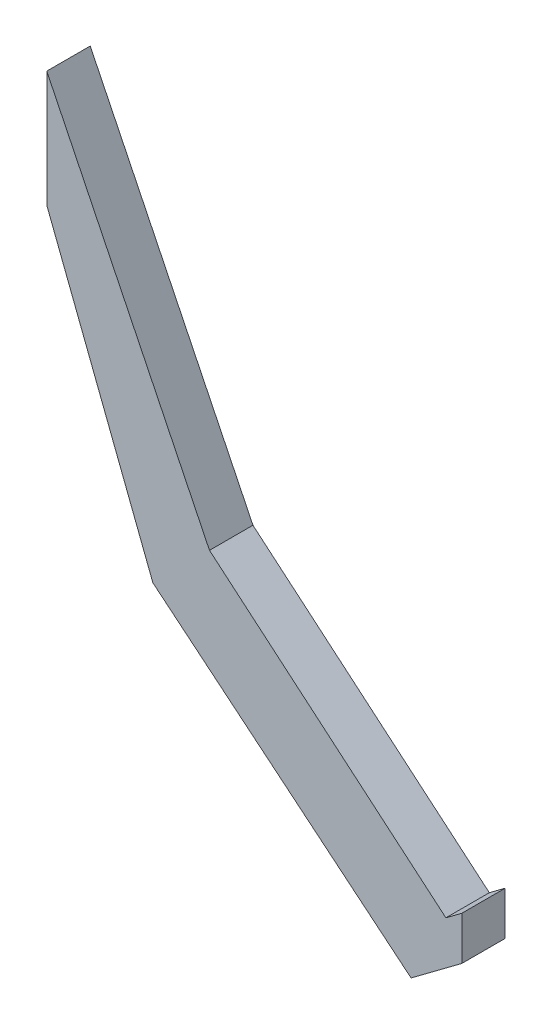
ISO-10303-21;
HEADER;
FILE_DESCRIPTION(('STEP AP214'),'2;1');
FILE_NAME('part.step','',(''),(''),'','','');
FILE_SCHEMA(('AUTOMOTIVE_DESIGN { 1 0 10303 214 1 1 1 1 }'));
ENDSEC;
DATA;
#1=APPLICATION_CONTEXT('core data for automotive mechanical design processes');
#2=APPLICATION_PROTOCOL_DEFINITION('international standard','automotive_design',2000,#1);
#3=PRODUCT_CONTEXT('',#1,'mechanical');
#4=PRODUCT('Part','Part','',(#3));
#5=PRODUCT_RELATED_PRODUCT_CATEGORY('part','',(#4));
#6=PRODUCT_DEFINITION_FORMATION('','',#4);
#7=PRODUCT_DEFINITION_CONTEXT('part definition',#1,'design');
#8=PRODUCT_DEFINITION('design','',#6,#7);
#9=PRODUCT_DEFINITION_SHAPE('','',#8);
#10=(LENGTH_UNIT() NAMED_UNIT(*) SI_UNIT(.MILLI.,.METRE.));
#11=(NAMED_UNIT(*) PLANE_ANGLE_UNIT() SI_UNIT($,.RADIAN.));
#12=(NAMED_UNIT(*) SI_UNIT($,.STERADIAN.) SOLID_ANGLE_UNIT());
#13=UNCERTAINTY_MEASURE_WITH_UNIT(LENGTH_MEASURE(1.E-05),#10,'distance_accuracy_value','');
#14=(GEOMETRIC_REPRESENTATION_CONTEXT(3) GLOBAL_UNCERTAINTY_ASSIGNED_CONTEXT((#13)) GLOBAL_UNIT_ASSIGNED_CONTEXT((#10,
#11,#12)) REPRESENTATION_CONTEXT('',''));
#15=CARTESIAN_POINT('',(0.,0.,0.));
#16=DIRECTION('',(0.,0.,1.));
#17=DIRECTION('',(1.,0.,0.));
#18=AXIS2_PLACEMENT_3D('',#15,#16,#17);
#19=CARTESIAN_POINT('',(-48.4510576676489,38.3967930670941,5.));
#20=DIRECTION('',(-0.89882004177812,-0.438317844147348,0.));
#21=DIRECTION('',(0.438317844147348,-0.89882004177812,0.));
#22=AXIS2_PLACEMENT_3D('',#19,#20,#21);
#23=PLANE('',#22);
#24=DIRECTION('',(-0.438317844147348,0.89882004177812,0.));
#25=VECTOR('',#24,1.);
#26=CARTESIAN_POINT('',(-48.4510576676489,38.3967930670941,0.));
#27=LINE('',#26,#25);
#28=CARTESIAN_POINT('',(-29.7265090627401,0.,0.));
#29=VERTEX_POINT('',#28);
#30=CARTESIAN_POINT('',(-48.4510576676489,38.3967930670941,0.));
#31=VERTEX_POINT('',#30);
#32=EDGE_CURVE('E131',#29,#31,#27,.T.);
#33=ORIENTED_EDGE('',*,*,#32,.T.);
#34=DIRECTION('',(0.,0.,-1.));
#35=VECTOR('',#34,1.);
#36=CARTESIAN_POINT('',(-48.4510576676489,38.3967930670941,5.));
#37=LINE('',#36,#35);
#38=CARTESIAN_POINT('',(-48.4510576676489,38.3967930670941,5.));
#39=VERTEX_POINT('',#38);
#40=EDGE_CURVE('E11',#39,#31,#37,.T.);
#41=ORIENTED_EDGE('',*,*,#40,.F.);
#42=DIRECTION('',(-0.438317844147348,0.89882004177812,0.));
#43=VECTOR('',#42,1.);
#44=CARTESIAN_POINT('',(-48.4510576676489,38.3967930670941,5.));
#45=LINE('',#44,#43);
#46=CARTESIAN_POINT('',(-29.7265090627401,0.,5.));
#47=VERTEX_POINT('',#46);
#48=EDGE_CURVE('E145',#47,#39,#45,.T.);
#49=ORIENTED_EDGE('',*,*,#48,.F.);
#50=DIRECTION('',(0.,0.,-1.));
#51=VECTOR('',#50,1.);
#52=CARTESIAN_POINT('',(-29.7265090627401,0.,5.));
#53=LINE('',#52,#51);
#54=EDGE_CURVE('E127',#47,#29,#53,.T.);
#55=ORIENTED_EDGE('',*,*,#54,.T.);
#56=EDGE_LOOP('',(#33,#41,#49,#55));
#57=FACE_BOUND('',#56,.T.);
#58=ADVANCED_FACE('F35',(#57),#23,.F.);
#59=CARTESIAN_POINT('',(-48.4510576676489,25.0386405763315,5.));
#60=DIRECTION('',(1.,0.,0.));
#61=DIRECTION('',(0.,0.,-1.));
#62=AXIS2_PLACEMENT_3D('',#59,#60,#61);
#63=PLANE('',#62);
#64=DIRECTION('',(0.,-1.,0.));
#65=VECTOR('',#64,1.);
#66=CARTESIAN_POINT('',(-48.4510576676489,25.0386405763315,0.));
#67=LINE('',#66,#65);
#68=CARTESIAN_POINT('',(-48.4510576676489,25.0386405763315,0.));
#69=VERTEX_POINT('',#68);
#70=EDGE_CURVE('E134',#31,#69,#67,.T.);
#71=ORIENTED_EDGE('',*,*,#70,.T.);
#72=DIRECTION('',(0.,0.,-1.));
#73=VECTOR('',#72,1.);
#74=CARTESIAN_POINT('',(-48.4510576676489,25.0386405763315,5.));
#75=LINE('',#74,#73);
#76=CARTESIAN_POINT('',(-48.4510576676489,25.0386405763315,5.));
#77=VERTEX_POINT('',#76);
#78=EDGE_CURVE('E43',#77,#69,#75,.T.);
#79=ORIENTED_EDGE('',*,*,#78,.F.);
#80=DIRECTION('',(0.,-1.,0.));
#81=VECTOR('',#80,1.);
#82=CARTESIAN_POINT('',(-48.4510576676489,25.0386405763315,5.));
#83=LINE('',#82,#81);
#84=EDGE_CURVE('E94',#39,#77,#83,.T.);
#85=ORIENTED_EDGE('',*,*,#84,.F.);
#86=ORIENTED_EDGE('',*,*,#40,.T.);
#87=EDGE_LOOP('',(#71,#79,#85,#86));
#88=FACE_BOUND('',#87,.T.);
#89=ADVANCED_FACE('F180',(#88),#63,.F.);
#90=CARTESIAN_POINT('',(-48.4510576676489,25.0386405763315,5.));
#91=DIRECTION('',(0.93251288962334,0.361136692522829,0.));
#92=DIRECTION('',(-0.361136692522829,0.93251288962334,0.));
#93=AXIS2_PLACEMENT_3D('',#90,#91,#92);
#94=PLANE('',#93);
#95=DIRECTION('',(0.361136692522829,-0.93251288962334,0.));
#96=VECTOR('',#95,1.);
#97=CARTESIAN_POINT('',(-48.4510576676489,25.0386405763315,0.));
#98=LINE('',#97,#96);
#99=CARTESIAN_POINT('',(-36.2400384473845,-6.49217048246183,0.));
#100=VERTEX_POINT('',#99);
#101=EDGE_CURVE('E136',#69,#100,#98,.T.);
#102=ORIENTED_EDGE('',*,*,#101,.T.);
#103=DIRECTION('',(0.,0.,-1.));
#104=VECTOR('',#103,1.);
#105=CARTESIAN_POINT('',(-36.2400384473845,-6.49217048246183,5.));
#106=LINE('',#105,#104);
#107=CARTESIAN_POINT('',(-36.2400384473845,-6.49217048246183,5.));
#108=VERTEX_POINT('',#107);
#109=EDGE_CURVE('E152',#108,#100,#106,.T.);
#110=ORIENTED_EDGE('',*,*,#109,.F.);
#111=DIRECTION('',(0.361136692522829,-0.93251288962334,0.));
#112=VECTOR('',#111,1.);
#113=CARTESIAN_POINT('',(-48.4510576676489,25.0386405763315,5.));
#114=LINE('',#113,#112);
#115=EDGE_CURVE('E160',#77,#108,#114,.T.);
#116=ORIENTED_EDGE('',*,*,#115,.F.);
#117=ORIENTED_EDGE('',*,*,#78,.T.);
#118=EDGE_LOOP('',(#102,#110,#116,#117));
#119=FACE_BOUND('',#118,.T.);
#120=ADVANCED_FACE('F158',(#119),#94,.F.);
#121=CARTESIAN_POINT('',(-36.2400384473845,-6.49217048246183,5.));
#122=DIRECTION('',(0.636631574307222,0.771168100089149,0.));
#123=DIRECTION('',(-0.771168100089149,0.636631574307222,0.));
#124=AXIS2_PLACEMENT_3D('',#121,#122,#123);
#125=PLANE('',#124);
#126=DIRECTION('',(0.771168100089149,-0.636631574307222,0.));
#127=VECTOR('',#126,1.);
#128=CARTESIAN_POINT('',(-36.2400384473845,-6.49217048246183,0.));
#129=LINE('',#128,#127);
#130=CARTESIAN_POINT('',(-6.52909275616516,-31.0198008750711,0.));
#131=VERTEX_POINT('',#130);
#132=EDGE_CURVE('E138',#100,#131,#129,.T.);
#133=ORIENTED_EDGE('',*,*,#132,.T.);
#134=DIRECTION('',(0.,0.,-1.));
#135=VECTOR('',#134,1.);
#136=CARTESIAN_POINT('',(-6.52909275616516,-31.0198008750711,5.));
#137=LINE('',#136,#135);
#138=CARTESIAN_POINT('',(-6.52909275616516,-31.0198008750711,5.));
#139=VERTEX_POINT('',#138);
#140=EDGE_CURVE('E149',#139,#131,#137,.T.);
#141=ORIENTED_EDGE('',*,*,#140,.F.);
#142=DIRECTION('',(0.771168100089149,-0.636631574307222,0.));
#143=VECTOR('',#142,1.);
#144=CARTESIAN_POINT('',(-36.2400384473845,-6.49217048246183,5.));
#145=LINE('',#144,#143);
#146=EDGE_CURVE('E172',#108,#139,#145,.T.);
#147=ORIENTED_EDGE('',*,*,#146,.F.);
#148=ORIENTED_EDGE('',*,*,#109,.T.);
#149=EDGE_LOOP('',(#133,#141,#147,#148));
#150=FACE_BOUND('',#149,.T.);
#151=ADVANCED_FACE('F168',(#150),#125,.F.);
#152=CARTESIAN_POINT('',(-0.693903445079616,-26.6560940859115,5.));
#153=DIRECTION('',(-0.598885213021196,0.80083487787718,0.));
#154=DIRECTION('',(-0.80083487787718,-0.598885213021196,0.));
#155=AXIS2_PLACEMENT_3D('',#152,#153,#154);
#156=PLANE('',#155);
#157=DIRECTION('',(0.80083487787718,0.598885213021196,0.));
#158=VECTOR('',#157,1.);
#159=CARTESIAN_POINT('',(-0.693903445079616,-26.6560940859115,0.));
#160=LINE('',#159,#158);
#161=CARTESIAN_POINT('',(-0.693903445079616,-26.6560940859115,0.));
#162=VERTEX_POINT('',#161);
#163=EDGE_CURVE('E140',#131,#162,#160,.T.);
#164=ORIENTED_EDGE('',*,*,#163,.T.);
#165=DIRECTION('',(0.,0.,-1.));
#166=VECTOR('',#165,1.);
#167=CARTESIAN_POINT('',(-0.693903445079616,-26.6560940859115,5.));
#168=LINE('',#167,#166);
#169=CARTESIAN_POINT('',(-0.693903445079616,-26.6560940859115,5.));
#170=VERTEX_POINT('',#169);
#171=EDGE_CURVE('E122',#170,#162,#168,.T.);
#172=ORIENTED_EDGE('',*,*,#171,.F.);
#173=DIRECTION('',(0.80083487787718,0.598885213021196,0.));
#174=VECTOR('',#173,1.);
#175=CARTESIAN_POINT('',(-0.693903445079616,-26.6560940859115,5.));
#176=LINE('',#175,#174);
#177=EDGE_CURVE('E113',#139,#170,#176,.T.);
#178=ORIENTED_EDGE('',*,*,#177,.F.);
#179=ORIENTED_EDGE('',*,*,#140,.T.);
#180=EDGE_LOOP('',(#164,#172,#178,#179));
#181=FACE_BOUND('',#180,.T.);
#182=ADVANCED_FACE('F171',(#181),#156,.F.);
#183=CARTESIAN_POINT('',(-0.693903445079618,-21.6496036691413,5.));
#184=DIRECTION('',(-1.,0.,0.));
#185=DIRECTION('',(0.,-1.,0.));
#186=AXIS2_PLACEMENT_3D('',#183,#184,#185);
#187=PLANE('',#186);
#188=DIRECTION('',(0.,1.,0.));
#189=VECTOR('',#188,1.);
#190=CARTESIAN_POINT('',(-0.693903445079618,-21.6496036691413,0.));
#191=LINE('',#190,#189);
#192=CARTESIAN_POINT('',(-0.693903445079618,-21.6496036691413,0.));
#193=VERTEX_POINT('',#192);
#194=EDGE_CURVE('E121',#162,#193,#191,.T.);
#195=ORIENTED_EDGE('',*,*,#194,.T.);
#196=DIRECTION('',(0.,0.,-1.));
#197=VECTOR('',#196,1.);
#198=CARTESIAN_POINT('',(-0.693903445079618,-21.6496036691413,5.));
#199=LINE('',#198,#197);
#200=CARTESIAN_POINT('',(-0.693903445079618,-21.6496036691413,5.));
#201=VERTEX_POINT('',#200);
#202=EDGE_CURVE('E118',#201,#193,#199,.T.);
#203=ORIENTED_EDGE('',*,*,#202,.F.);
#204=DIRECTION('',(0.,1.,0.));
#205=VECTOR('',#204,1.);
#206=CARTESIAN_POINT('',(-0.693903445079618,-21.6496036691413,5.));
#207=LINE('',#206,#205);
#208=EDGE_CURVE('E107',#170,#201,#207,.T.);
#209=ORIENTED_EDGE('',*,*,#208,.F.);
#210=ORIENTED_EDGE('',*,*,#171,.T.);
#211=EDGE_LOOP('',(#195,#203,#209,#210));
#212=FACE_BOUND('',#211,.T.);
#213=ADVANCED_FACE('F119',(#212),#187,.F.);
#214=CARTESIAN_POINT('',(-2.52356742219561,-23.0178741215933,5.));
#215=DIRECTION('',(0.598885213021194,-0.800834877877181,0.));
#216=DIRECTION('',(0.800834877877181,0.598885213021194,0.));
#217=AXIS2_PLACEMENT_3D('',#214,#215,#216);
#218=PLANE('',#217);
#219=DIRECTION('',(-0.800834877877181,-0.598885213021194,0.));
#220=VECTOR('',#219,1.);
#221=CARTESIAN_POINT('',(-2.52356742219561,-23.0178741215933,0.));
#222=LINE('',#221,#220);
#223=CARTESIAN_POINT('',(-2.52356742219561,-23.0178741215933,0.));
#224=VERTEX_POINT('',#223);
#225=EDGE_CURVE('E80',#193,#224,#222,.T.);
#226=ORIENTED_EDGE('',*,*,#225,.T.);
#227=DIRECTION('',(0.,0.,-1.));
#228=VECTOR('',#227,1.);
#229=CARTESIAN_POINT('',(-2.52356742219561,-23.0178741215933,5.));
#230=LINE('',#229,#228);
#231=CARTESIAN_POINT('',(-2.52356742219561,-23.0178741215933,5.));
#232=VERTEX_POINT('',#231);
#233=EDGE_CURVE('E123',#232,#224,#230,.T.);
#234=ORIENTED_EDGE('',*,*,#233,.F.);
#235=DIRECTION('',(-0.800834877877181,-0.598885213021194,0.));
#236=VECTOR('',#235,1.);
#237=CARTESIAN_POINT('',(-2.52356742219561,-23.0178741215933,5.));
#238=LINE('',#237,#236);
#239=EDGE_CURVE('E111',#201,#232,#238,.T.);
#240=ORIENTED_EDGE('',*,*,#239,.F.);
#241=ORIENTED_EDGE('',*,*,#202,.T.);
#242=EDGE_LOOP('',(#226,#234,#240,#241));
#243=FACE_BOUND('',#242,.T.);
#244=ADVANCED_FACE('F125',(#243),#218,.F.);
#245=CARTESIAN_POINT('',(-29.7265090627401,0.,5.));
#246=DIRECTION('',(-0.645942248428746,-0.763386279477707,0.));
#247=DIRECTION('',(0.763386279477707,-0.645942248428746,0.));
#248=AXIS2_PLACEMENT_3D('',#245,#246,#247);
#249=PLANE('',#248);
#250=DIRECTION('',(-0.763386279477707,0.645942248428746,0.));
#251=VECTOR('',#250,1.);
#252=CARTESIAN_POINT('',(-29.7265090627401,0.,0.));
#253=LINE('',#252,#251);
#254=EDGE_CURVE('E86',#224,#29,#253,.T.);
#255=ORIENTED_EDGE('',*,*,#254,.T.);
#256=ORIENTED_EDGE('',*,*,#54,.F.);
#257=DIRECTION('',(-0.763386279477707,0.645942248428746,0.));
#258=VECTOR('',#257,1.);
#259=CARTESIAN_POINT('',(-29.7265090627401,0.,5.));
#260=LINE('',#259,#258);
#261=EDGE_CURVE('E51',#232,#47,#260,.T.);
#262=ORIENTED_EDGE('',*,*,#261,.F.);
#263=ORIENTED_EDGE('',*,*,#233,.T.);
#264=EDGE_LOOP('',(#255,#256,#262,#263));
#265=FACE_BOUND('',#264,.T.);
#266=ADVANCED_FACE('F196',(#265),#249,.F.);
#267=CARTESIAN_POINT('',(0.,0.,5.));
#268=DIRECTION('',(0.,0.,1.));
#269=DIRECTION('',(1.,0.,0.));
#270=AXIS2_PLACEMENT_3D('',#267,#268,#269);
#271=PLANE('',#270);
#272=ORIENTED_EDGE('',*,*,#48,.T.);
#273=ORIENTED_EDGE('',*,*,#84,.T.);
#274=ORIENTED_EDGE('',*,*,#115,.T.);
#275=ORIENTED_EDGE('',*,*,#146,.T.);
#276=ORIENTED_EDGE('',*,*,#177,.T.);
#277=ORIENTED_EDGE('',*,*,#208,.T.);
#278=ORIENTED_EDGE('',*,*,#239,.T.);
#279=ORIENTED_EDGE('',*,*,#261,.T.);
#280=EDGE_LOOP('',(#272,#273,#274,#275,#276,#277,#278,#279));
#281=FACE_BOUND('',#280,.T.);
#282=ADVANCED_FACE('F109',(#281),#271,.T.);
#283=CARTESIAN_POINT('',(0.,0.,0.));
#284=DIRECTION('',(0.,0.,1.));
#285=DIRECTION('',(1.,0.,0.));
#286=AXIS2_PLACEMENT_3D('',#283,#284,#285);
#287=PLANE('',#286);
#288=ORIENTED_EDGE('',*,*,#32,.F.);
#289=ORIENTED_EDGE('',*,*,#254,.F.);
#290=ORIENTED_EDGE('',*,*,#225,.F.);
#291=ORIENTED_EDGE('',*,*,#194,.F.);
#292=ORIENTED_EDGE('',*,*,#163,.F.);
#293=ORIENTED_EDGE('',*,*,#132,.F.);
#294=ORIENTED_EDGE('',*,*,#101,.F.);
#295=ORIENTED_EDGE('',*,*,#70,.F.);
#296=EDGE_LOOP('',(#288,#289,#290,#291,#292,#293,#294,#295));
#297=FACE_BOUND('',#296,.T.);
#298=ADVANCED_FACE('F164',(#297),#287,.F.);
#299=CLOSED_SHELL('',(#58,#89,#120,#151,#182,#213,#244,#266,#282,#298));
#300=MANIFOLD_SOLID_BREP('B2',#299);
#301=ADVANCED_BREP_SHAPE_REPRESENTATION('',(#18,#300),#14);
#302=SHAPE_DEFINITION_REPRESENTATION(#9,#301);
ENDSEC;
END-ISO-10303-21;
